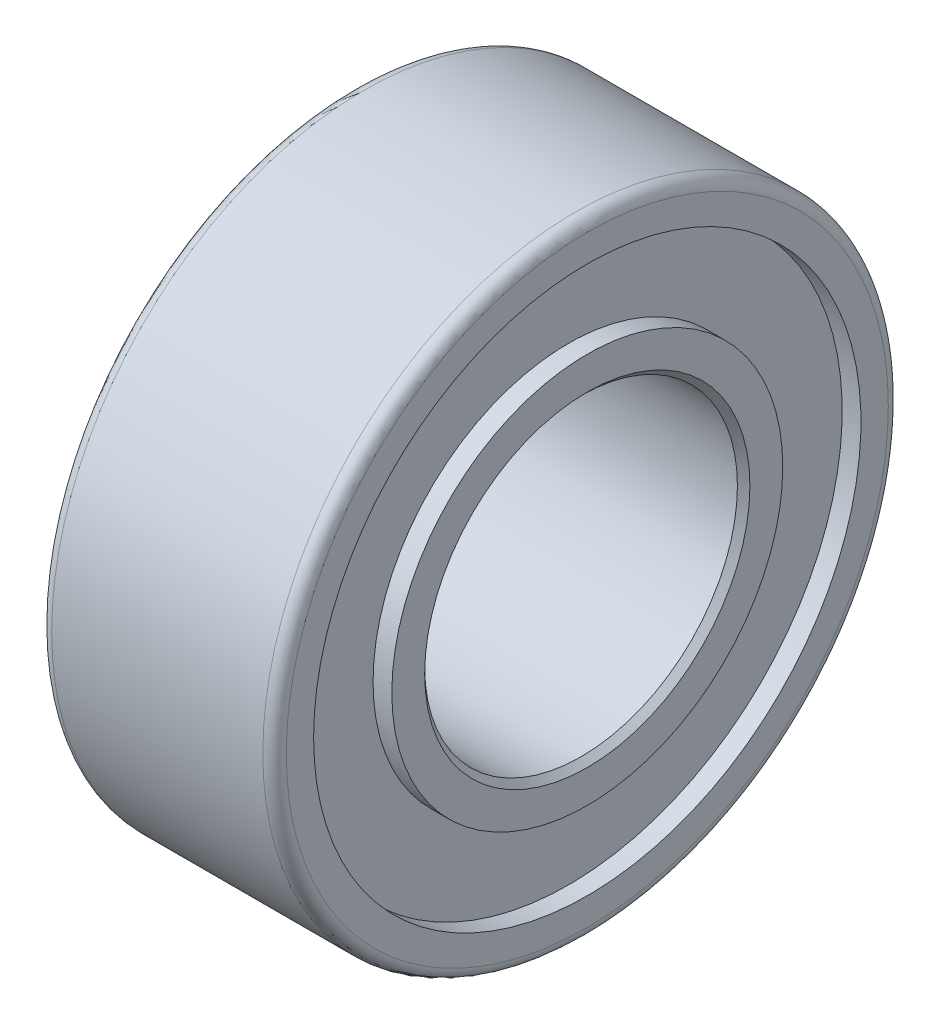
ISO-10303-21;
HEADER;
FILE_DESCRIPTION(('STEP AP214'),'2;1');
FILE_NAME('part.step','',(''),(''),'','','');
FILE_SCHEMA(('AUTOMOTIVE_DESIGN { 1 0 10303 214 1 1 1 1 }'));
ENDSEC;
DATA;
#1=APPLICATION_CONTEXT('core data for automotive mechanical design processes');
#2=APPLICATION_PROTOCOL_DEFINITION('international standard','automotive_design',2000,#1);
#3=PRODUCT_CONTEXT('',#1,'mechanical');
#4=PRODUCT('Part','Part','',(#3));
#5=PRODUCT_RELATED_PRODUCT_CATEGORY('part','',(#4));
#6=PRODUCT_DEFINITION_FORMATION('','',#4);
#7=PRODUCT_DEFINITION_CONTEXT('part definition',#1,'design');
#8=PRODUCT_DEFINITION('design','',#6,#7);
#9=PRODUCT_DEFINITION_SHAPE('','',#8);
#10=(LENGTH_UNIT() NAMED_UNIT(*) SI_UNIT(.MILLI.,.METRE.));
#11=(NAMED_UNIT(*) PLANE_ANGLE_UNIT() SI_UNIT($,.RADIAN.));
#12=(NAMED_UNIT(*) SI_UNIT($,.STERADIAN.) SOLID_ANGLE_UNIT());
#13=UNCERTAINTY_MEASURE_WITH_UNIT(LENGTH_MEASURE(1.E-05),#10,'distance_accuracy_value','');
#14=(GEOMETRIC_REPRESENTATION_CONTEXT(3) GLOBAL_UNCERTAINTY_ASSIGNED_CONTEXT((#13)) GLOBAL_UNIT_ASSIGNED_CONTEXT((#10,
#11,#12)) REPRESENTATION_CONTEXT('',''));
#15=CARTESIAN_POINT('',(0.,0.,0.));
#16=DIRECTION('',(0.,0.,1.));
#17=DIRECTION('',(1.,0.,0.));
#18=AXIS2_PLACEMENT_3D('',#15,#16,#17);
#19=CARTESIAN_POINT('',(0.,0.,0.));
#20=DIRECTION('',(-1.,0.,0.));
#21=DIRECTION('',(0.,0.,1.));
#22=AXIS2_PLACEMENT_3D('',#19,#20,#21);
#23=CYLINDRICAL_SURFACE('',#22,3.175);
#24=CARTESIAN_POINT('',(-2.25424999996449,0.,0.));
#25=DIRECTION('',(-1.,0.,0.));
#26=DIRECTION('',(0.,0.,1.));
#27=AXIS2_PLACEMENT_3D('',#24,#25,#26);
#28=CIRCLE('',#27,3.17499999999882);
#29=CARTESIAN_POINT('',(-2.25424999996449,0.,3.17499999999882));
#30=VERTEX_POINT('',#29);
#31=EDGE_CURVE('E72',#30,#30,#28,.T.);
#32=ORIENTED_EDGE('',*,*,#31,.T.);
#33=EDGE_LOOP('',(#32));
#34=FACE_BOUND('',#33,.T.);
#35=CARTESIAN_POINT('',(2.25425000002133,0.,0.));
#36=DIRECTION('',(1.,0.,0.));
#37=DIRECTION('',(0.,0.,-1.));
#38=AXIS2_PLACEMENT_3D('',#35,#36,#37);
#39=CIRCLE('',#38,3.17500000005566);
#40=CARTESIAN_POINT('',(2.25425000002133,0.,-3.17500000005566));
#41=VERTEX_POINT('',#40);
#42=EDGE_CURVE('E135',#41,#41,#39,.T.);
#43=ORIENTED_EDGE('',*,*,#42,.T.);
#44=EDGE_LOOP('',(#43));
#45=FACE_BOUND('',#44,.T.);
#46=ADVANCED_FACE('F21',(#34,#45),#23,.F.);
#47=CARTESIAN_POINT('',(2.38125000004175,0.,0.));
#48=DIRECTION('',(1.,0.,0.));
#49=DIRECTION('',(0.,0.,-1.));
#50=AXIS2_PLACEMENT_3D('',#47,#48,#49);
#51=CONICAL_SURFACE('',#50,3.30200000001923,0.785398163173655);
#52=CARTESIAN_POINT('',(2.38125000004175,0.,0.));
#53=DIRECTION('',(1.,0.,0.));
#54=DIRECTION('',(0.,0.,-1.));
#55=AXIS2_PLACEMENT_3D('',#52,#53,#54);
#56=CIRCLE('',#55,3.30200000001923);
#57=CARTESIAN_POINT('',(2.38125000004175,0.,-3.30200000001923));
#58=VERTEX_POINT('',#57);
#59=EDGE_CURVE('E175',#58,#58,#56,.T.);
#60=ORIENTED_EDGE('',*,*,#59,.T.);
#61=EDGE_LOOP('',(#60));
#62=FACE_BOUND('',#61,.T.);
#63=ORIENTED_EDGE('',*,*,#42,.F.);
#64=EDGE_LOOP('',(#63));
#65=FACE_BOUND('',#64,.T.);
#66=ADVANCED_FACE('F204',(#62,#65),#51,.F.);
#67=CARTESIAN_POINT('',(-2.38124999992806,0.,0.));
#68=DIRECTION('',(-1.,0.,0.));
#69=DIRECTION('',(0.,0.,1.));
#70=AXIS2_PLACEMENT_3D('',#67,#68,#69);
#71=CONICAL_SURFACE('',#70,3.30199999990555,0.785398163397448);
#72=CARTESIAN_POINT('',(-2.3812499999849,0.,0.));
#73=DIRECTION('',(-1.,0.,0.));
#74=DIRECTION('',(0.,0.,1.));
#75=AXIS2_PLACEMENT_3D('',#72,#73,#74);
#76=CIRCLE('',#75,3.30199999996239);
#77=CARTESIAN_POINT('',(-2.3812499999849,0.,3.30199999996239));
#78=VERTEX_POINT('',#77);
#79=EDGE_CURVE('E169',#78,#78,#76,.T.);
#80=ORIENTED_EDGE('',*,*,#79,.T.);
#81=EDGE_LOOP('',(#80));
#82=FACE_BOUND('',#81,.T.);
#83=ORIENTED_EDGE('',*,*,#31,.F.);
#84=EDGE_LOOP('',(#83));
#85=FACE_BOUND('',#84,.T.);
#86=ADVANCED_FACE('F206',(#82,#85),#71,.F.);
#87=CARTESIAN_POINT('',(2.38125,3.175,0.));
#88=DIRECTION('',(-1.,0.,0.));
#89=DIRECTION('',(0.,0.,1.));
#90=AXIS2_PLACEMENT_3D('',#87,#88,#89);
#91=PLANE('',#90);
#92=CARTESIAN_POINT('',(2.38125,0.,0.));
#93=DIRECTION('',(-1.,0.,0.));
#94=DIRECTION('',(0.,0.,1.));
#95=AXIS2_PLACEMENT_3D('',#92,#93,#94);
#96=CIRCLE('',#95,3.96875);
#97=CARTESIAN_POINT('',(2.38125,0.,3.96875));
#98=VERTEX_POINT('',#97);
#99=EDGE_CURVE('E165',#98,#98,#96,.T.);
#100=ORIENTED_EDGE('',*,*,#99,.F.);
#101=EDGE_LOOP('',(#100));
#102=FACE_BOUND('',#101,.T.);
#103=ORIENTED_EDGE('',*,*,#59,.F.);
#104=EDGE_LOOP('',(#103));
#105=FACE_BOUND('',#104,.T.);
#106=ADVANCED_FACE('F213',(#102,#105),#91,.F.);
#107=CARTESIAN_POINT('',(-2.38125,3.96875,0.));
#108=DIRECTION('',(1.,0.,0.));
#109=DIRECTION('',(0.,0.,-1.));
#110=AXIS2_PLACEMENT_3D('',#107,#108,#109);
#111=PLANE('',#110);
#112=CARTESIAN_POINT('',(-2.38125,0.,0.));
#113=DIRECTION('',(-1.,0.,0.));
#114=DIRECTION('',(0.,0.,1.));
#115=AXIS2_PLACEMENT_3D('',#112,#113,#114);
#116=CIRCLE('',#115,3.96875);
#117=CARTESIAN_POINT('',(-2.38125,0.,3.96875));
#118=VERTEX_POINT('',#117);
#119=EDGE_CURVE('E161',#118,#118,#116,.F.);
#120=ORIENTED_EDGE('',*,*,#119,.F.);
#121=EDGE_LOOP('',(#120));
#122=FACE_BOUND('',#121,.T.);
#123=ORIENTED_EDGE('',*,*,#79,.F.);
#124=EDGE_LOOP('',(#123));
#125=FACE_BOUND('',#124,.T.);
#126=ADVANCED_FACE('F291',(#122,#125),#111,.F.);
#127=CARTESIAN_POINT('',(0.,0.,0.));
#128=DIRECTION('',(-1.,0.,0.));
#129=DIRECTION('',(0.,0.,1.));
#130=AXIS2_PLACEMENT_3D('',#127,#128,#129);
#131=CYLINDRICAL_SURFACE('',#130,3.96875);
#132=CARTESIAN_POINT('',(2.00025,0.,0.));
#133=DIRECTION('',(-1.,0.,0.));
#134=DIRECTION('',(0.,0.,1.));
#135=AXIS2_PLACEMENT_3D('',#132,#133,#134);
#136=CIRCLE('',#135,3.96875);
#137=CARTESIAN_POINT('',(2.00025,0.,3.96875));
#138=VERTEX_POINT('',#137);
#139=EDGE_CURVE('E157',#138,#138,#136,.F.);
#140=ORIENTED_EDGE('',*,*,#139,.T.);
#141=EDGE_LOOP('',(#140));
#142=FACE_BOUND('',#141,.T.);
#143=ORIENTED_EDGE('',*,*,#99,.T.);
#144=EDGE_LOOP('',(#143));
#145=FACE_BOUND('',#144,.T.);
#146=ADVANCED_FACE('F284',(#142,#145),#131,.T.);
#147=CARTESIAN_POINT('',(0.,0.,0.));
#148=DIRECTION('',(-1.,0.,0.));
#149=DIRECTION('',(0.,0.,1.));
#150=AXIS2_PLACEMENT_3D('',#147,#148,#149);
#151=CYLINDRICAL_SURFACE('',#150,3.96875);
#152=ORIENTED_EDGE('',*,*,#119,.T.);
#153=EDGE_LOOP('',(#152));
#154=FACE_BOUND('',#153,.T.);
#155=CARTESIAN_POINT('',(-2.00025,0.,0.));
#156=DIRECTION('',(-1.,0.,0.));
#157=DIRECTION('',(0.,0.,1.));
#158=AXIS2_PLACEMENT_3D('',#155,#156,#157);
#159=CIRCLE('',#158,3.96875);
#160=CARTESIAN_POINT('',(-2.00025,0.,3.96875));
#161=VERTEX_POINT('',#160);
#162=EDGE_CURVE('E152',#161,#161,#159,.T.);
#163=ORIENTED_EDGE('',*,*,#162,.T.);
#164=EDGE_LOOP('',(#163));
#165=FACE_BOUND('',#164,.T.);
#166=ADVANCED_FACE('F277',(#154,#165),#151,.T.);
#167=CARTESIAN_POINT('',(2.00025,3.96875,0.));
#168=DIRECTION('',(-1.,0.,0.));
#169=DIRECTION('',(0.,0.,1.));
#170=AXIS2_PLACEMENT_3D('',#167,#168,#169);
#171=PLANE('',#170);
#172=ORIENTED_EDGE('',*,*,#139,.F.);
#173=EDGE_LOOP('',(#172));
#174=FACE_BOUND('',#173,.T.);
#175=CARTESIAN_POINT('',(2.00025,0.,0.));
#176=DIRECTION('',(-1.,0.,0.));
#177=DIRECTION('',(0.,0.,1.));
#178=AXIS2_PLACEMENT_3D('',#175,#176,#177);
#179=CIRCLE('',#178,5.55625);
#180=CARTESIAN_POINT('',(2.00025,0.,5.55625));
#181=VERTEX_POINT('',#180);
#182=EDGE_CURVE('E145',#181,#181,#179,.F.);
#183=ORIENTED_EDGE('',*,*,#182,.T.);
#184=EDGE_LOOP('',(#183));
#185=FACE_BOUND('',#184,.T.);
#186=ADVANCED_FACE('F270',(#174,#185),#171,.F.);
#187=CARTESIAN_POINT('',(-2.00025,5.55625,0.));
#188=DIRECTION('',(1.,0.,0.));
#189=DIRECTION('',(0.,0.,-1.));
#190=AXIS2_PLACEMENT_3D('',#187,#188,#189);
#191=PLANE('',#190);
#192=CARTESIAN_POINT('',(-2.00025,0.,0.));
#193=DIRECTION('',(-1.,0.,0.));
#194=DIRECTION('',(0.,0.,1.));
#195=AXIS2_PLACEMENT_3D('',#192,#193,#194);
#196=CIRCLE('',#195,5.55625);
#197=CARTESIAN_POINT('',(-2.00025,0.,5.55625));
#198=VERTEX_POINT('',#197);
#199=EDGE_CURVE('E140',#198,#198,#196,.T.);
#200=ORIENTED_EDGE('',*,*,#199,.T.);
#201=EDGE_LOOP('',(#200));
#202=FACE_BOUND('',#201,.T.);
#203=ORIENTED_EDGE('',*,*,#162,.F.);
#204=EDGE_LOOP('',(#203));
#205=FACE_BOUND('',#204,.T.);
#206=ADVANCED_FACE('F263',(#202,#205),#191,.F.);
#207=CARTESIAN_POINT('',(0.,0.,0.));
#208=DIRECTION('',(-1.,0.,0.));
#209=DIRECTION('',(0.,0.,1.));
#210=AXIS2_PLACEMENT_3D('',#207,#208,#209);
#211=CYLINDRICAL_SURFACE('',#210,5.55625);
#212=CARTESIAN_POINT('',(2.38125,0.,0.));
#213=DIRECTION('',(-1.,0.,0.));
#214=DIRECTION('',(0.,0.,1.));
#215=AXIS2_PLACEMENT_3D('',#212,#213,#214);
#216=CIRCLE('',#215,5.55625);
#217=CARTESIAN_POINT('',(2.38125,0.,5.55625));
#218=VERTEX_POINT('',#217);
#219=EDGE_CURVE('E134',#218,#218,#216,.F.);
#220=ORIENTED_EDGE('',*,*,#219,.T.);
#221=EDGE_LOOP('',(#220));
#222=FACE_BOUND('',#221,.T.);
#223=ORIENTED_EDGE('',*,*,#182,.F.);
#224=EDGE_LOOP('',(#223));
#225=FACE_BOUND('',#224,.T.);
#226=ADVANCED_FACE('F256',(#222,#225),#211,.F.);
#227=CARTESIAN_POINT('',(0.,0.,0.));
#228=DIRECTION('',(-1.,0.,0.));
#229=DIRECTION('',(0.,0.,1.));
#230=AXIS2_PLACEMENT_3D('',#227,#228,#229);
#231=CYLINDRICAL_SURFACE('',#230,5.55625);
#232=ORIENTED_EDGE('',*,*,#199,.F.);
#233=EDGE_LOOP('',(#232));
#234=FACE_BOUND('',#233,.T.);
#235=CARTESIAN_POINT('',(-2.38125,0.,0.));
#236=DIRECTION('',(-1.,0.,0.));
#237=DIRECTION('',(0.,0.,1.));
#238=AXIS2_PLACEMENT_3D('',#235,#236,#237);
#239=CIRCLE('',#238,5.55625);
#240=CARTESIAN_POINT('',(-2.38125,0.,5.55625));
#241=VERTEX_POINT('',#240);
#242=EDGE_CURVE('E58',#241,#241,#239,.T.);
#243=ORIENTED_EDGE('',*,*,#242,.T.);
#244=EDGE_LOOP('',(#243));
#245=FACE_BOUND('',#244,.T.);
#246=ADVANCED_FACE('F250',(#234,#245),#231,.F.);
#247=CARTESIAN_POINT('',(2.38125,5.55625,0.));
#248=DIRECTION('',(-1.,0.,0.));
#249=DIRECTION('',(0.,0.,1.));
#250=AXIS2_PLACEMENT_3D('',#247,#248,#249);
#251=PLANE('',#250);
#252=ORIENTED_EDGE('',*,*,#219,.F.);
#253=EDGE_LOOP('',(#252));
#254=FACE_BOUND('',#253,.T.);
#255=CARTESIAN_POINT('',(2.38125,0.,0.));
#256=DIRECTION('',(-1.,0.,0.));
#257=DIRECTION('',(0.,0.,1.));
#258=AXIS2_PLACEMENT_3D('',#255,#256,#257);
#259=CIRCLE('',#258,6.111875);
#260=CARTESIAN_POINT('',(2.38125,0.,6.111875));
#261=VERTEX_POINT('',#260);
#262=CARTESIAN_POINT('',(2.38125,0.,-6.111875));
#263=VERTEX_POINT('',#262);
#264=EDGE_CURVE('E50',#261,#263,#259,.T.);
#265=ORIENTED_EDGE('',*,*,#264,.F.);
#266=CARTESIAN_POINT('',(2.38125,0.,0.));
#267=DIRECTION('',(-1.,0.,0.));
#268=DIRECTION('',(0.,0.,-1.));
#269=AXIS2_PLACEMENT_3D('',#266,#267,#268);
#270=CIRCLE('',#269,6.111875);
#271=EDGE_CURVE('E53',#263,#261,#270,.T.);
#272=ORIENTED_EDGE('',*,*,#271,.F.);
#273=EDGE_LOOP('',(#265,#272));
#274=FACE_BOUND('',#273,.T.);
#275=ADVANCED_FACE('F55',(#254,#274),#251,.F.);
#276=CARTESIAN_POINT('',(-2.38125,6.35,0.));
#277=DIRECTION('',(1.,0.,0.));
#278=DIRECTION('',(0.,0.,-1.));
#279=AXIS2_PLACEMENT_3D('',#276,#277,#278);
#280=PLANE('',#279);
#281=ORIENTED_EDGE('',*,*,#242,.F.);
#282=EDGE_LOOP('',(#281));
#283=FACE_BOUND('',#282,.T.);
#284=CARTESIAN_POINT('',(-2.38125,0.,0.));
#285=DIRECTION('',(1.,0.,0.));
#286=DIRECTION('',(0.,0.,-1.));
#287=AXIS2_PLACEMENT_3D('',#284,#285,#286);
#288=CIRCLE('',#287,6.111875);
#289=CARTESIAN_POINT('',(-2.38125,0.,-6.111875));
#290=VERTEX_POINT('',#289);
#291=CARTESIAN_POINT('',(-2.38125,0.,6.111875));
#292=VERTEX_POINT('',#291);
#293=EDGE_CURVE('E64',#290,#292,#288,.T.);
#294=ORIENTED_EDGE('',*,*,#293,.F.);
#295=CARTESIAN_POINT('',(-2.38125,0.,0.));
#296=DIRECTION('',(1.,0.,0.));
#297=DIRECTION('',(0.,0.,1.));
#298=AXIS2_PLACEMENT_3D('',#295,#296,#297);
#299=CIRCLE('',#298,6.111875);
#300=EDGE_CURVE('E41',#292,#290,#299,.T.);
#301=ORIENTED_EDGE('',*,*,#300,.F.);
#302=EDGE_LOOP('',(#294,#301));
#303=FACE_BOUND('',#302,.T.);
#304=ADVANCED_FACE('F87',(#283,#303),#280,.F.);
#305=CARTESIAN_POINT('',(2.143125,0.,0.));
#306=DIRECTION('',(-1.,0.,0.));
#307=DIRECTION('',(0.,0.,1.));
#308=AXIS2_PLACEMENT_3D('',#305,#306,#307);
#309=TOROIDAL_SURFACE('',#308,6.111875,0.238125);
#310=CARTESIAN_POINT('',(2.143125,0.,0.));
#311=DIRECTION('',(-1.,0.,0.));
#312=DIRECTION('',(0.,0.,1.));
#313=AXIS2_PLACEMENT_3D('',#310,#311,#312);
#314=CIRCLE('',#313,6.35);
#315=CARTESIAN_POINT('',(2.143125,0.,6.35));
#316=VERTEX_POINT('',#315);
#317=EDGE_CURVE('E33',#316,#316,#314,.T.);
#318=ORIENTED_EDGE('',*,*,#317,.F.);
#319=EDGE_LOOP('',(#318));
#320=FACE_BOUND('',#319,.T.);
#321=ORIENTED_EDGE('',*,*,#264,.T.);
#322=ORIENTED_EDGE('',*,*,#271,.T.);
#323=EDGE_LOOP('',(#321,#322));
#324=FACE_BOUND('',#323,.T.);
#325=ADVANCED_FACE('F62',(#320,#324),#309,.T.);
#326=CARTESIAN_POINT('',(-2.143125,0.,0.));
#327=DIRECTION('',(1.,0.,0.));
#328=DIRECTION('',(0.,0.,-1.));
#329=AXIS2_PLACEMENT_3D('',#326,#327,#328);
#330=TOROIDAL_SURFACE('',#329,6.111875,0.238125);
#331=CARTESIAN_POINT('',(-2.143125,0.,0.));
#332=DIRECTION('',(-1.,0.,0.));
#333=DIRECTION('',(0.,0.,1.));
#334=AXIS2_PLACEMENT_3D('',#331,#332,#333);
#335=CIRCLE('',#334,6.35);
#336=CARTESIAN_POINT('',(-2.143125,0.,6.35));
#337=VERTEX_POINT('',#336);
#338=EDGE_CURVE('E12',#337,#337,#335,.F.);
#339=ORIENTED_EDGE('',*,*,#338,.F.);
#340=EDGE_LOOP('',(#339));
#341=FACE_BOUND('',#340,.T.);
#342=ORIENTED_EDGE('',*,*,#293,.T.);
#343=ORIENTED_EDGE('',*,*,#300,.T.);
#344=EDGE_LOOP('',(#342,#343));
#345=FACE_BOUND('',#344,.T.);
#346=ADVANCED_FACE('F86',(#341,#345),#330,.T.);
#347=CARTESIAN_POINT('',(0.,0.,0.));
#348=DIRECTION('',(-1.,0.,0.));
#349=DIRECTION('',(0.,0.,1.));
#350=AXIS2_PLACEMENT_3D('',#347,#348,#349);
#351=CYLINDRICAL_SURFACE('',#350,6.35);
#352=ORIENTED_EDGE('',*,*,#338,.T.);
#353=EDGE_LOOP('',(#352));
#354=FACE_BOUND('',#353,.T.);
#355=ORIENTED_EDGE('',*,*,#317,.T.);
#356=EDGE_LOOP('',(#355));
#357=FACE_BOUND('',#356,.T.);
#358=ADVANCED_FACE('F217',(#354,#357),#351,.T.);
#359=CLOSED_SHELL('',(#46,#66,#86,#106,#126,#146,#166,#186,#206,#226,#246,#275,#304,#325,#346,#358));
#360=MANIFOLD_SOLID_BREP('B1',#359);
#361=ADVANCED_BREP_SHAPE_REPRESENTATION('',(#18,#360),#14);
#362=SHAPE_DEFINITION_REPRESENTATION(#9,#361);
ENDSEC;
END-ISO-10303-21;
